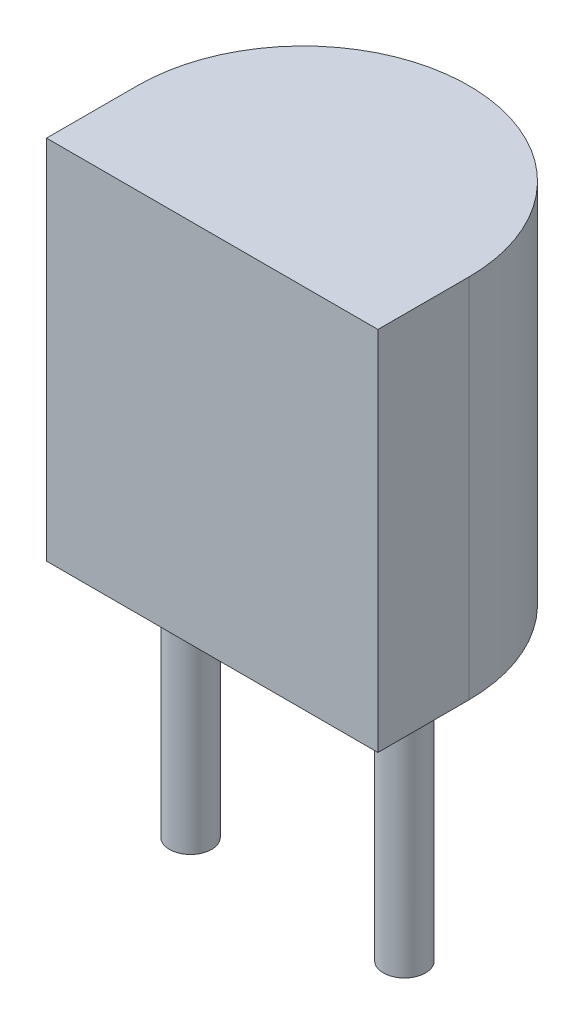
ISO-10303-21;
HEADER;
FILE_DESCRIPTION(('STEP AP214'),'2;1');
FILE_NAME('part.step','',(''),(''),'','','');
FILE_SCHEMA(('AUTOMOTIVE_DESIGN { 1 0 10303 214 1 1 1 1 }'));
ENDSEC;
DATA;
#1=APPLICATION_CONTEXT('core data for automotive mechanical design processes');
#2=APPLICATION_PROTOCOL_DEFINITION('international standard','automotive_design',2000,#1);
#3=PRODUCT_CONTEXT('',#1,'mechanical');
#4=PRODUCT('Part','Part','',(#3));
#5=PRODUCT_RELATED_PRODUCT_CATEGORY('part','',(#4));
#6=PRODUCT_DEFINITION_FORMATION('','',#4);
#7=PRODUCT_DEFINITION_CONTEXT('part definition',#1,'design');
#8=PRODUCT_DEFINITION('design','',#6,#7);
#9=PRODUCT_DEFINITION_SHAPE('','',#8);
#10=(LENGTH_UNIT() NAMED_UNIT(*) SI_UNIT(.MILLI.,.METRE.));
#11=(NAMED_UNIT(*) PLANE_ANGLE_UNIT() SI_UNIT($,.RADIAN.));
#12=(NAMED_UNIT(*) SI_UNIT($,.STERADIAN.) SOLID_ANGLE_UNIT());
#13=UNCERTAINTY_MEASURE_WITH_UNIT(LENGTH_MEASURE(1.E-05),#10,'distance_accuracy_value','');
#14=(GEOMETRIC_REPRESENTATION_CONTEXT(3) GLOBAL_UNCERTAINTY_ASSIGNED_CONTEXT((#13)) GLOBAL_UNIT_ASSIGNED_CONTEXT((#10,
#11,#12)) REPRESENTATION_CONTEXT('',''));
#15=CARTESIAN_POINT('',(0.,0.,0.));
#16=DIRECTION('',(0.,0.,1.));
#17=DIRECTION('',(1.,0.,0.));
#18=AXIS2_PLACEMENT_3D('',#15,#16,#17);
#19=CARTESIAN_POINT('',(-2.535,3.,-0.13));
#20=DIRECTION('',(0.,1.,0.));
#21=DIRECTION('',(0.,0.,1.));
#22=AXIS2_PLACEMENT_3D('',#19,#20,#21);
#23=PLANE('',#22);
#24=CARTESIAN_POINT('',(-2.54,3.,-2.54));
#25=DIRECTION('',(0.,1.,0.));
#26=DIRECTION('',(0.,0.,1.));
#27=AXIS2_PLACEMENT_3D('',#24,#25,#26);
#28=CIRCLE('',#27,0.500000000000001);
#29=CARTESIAN_POINT('',(-2.54,3.,-2.04));
#30=VERTEX_POINT('',#29);
#31=EDGE_CURVE('E42',#30,#30,#28,.F.);
#32=ORIENTED_EDGE('',*,*,#31,.F.);
#33=EDGE_LOOP('',(#32));
#34=FACE_BOUND('',#33,.T.);
#35=CARTESIAN_POINT('',(-2.535,3.,-0.13));
#36=DIRECTION('',(0.,1.,0.));
#37=DIRECTION('',(0.,0.,1.));
#38=AXIS2_PLACEMENT_3D('',#35,#36,#37);
#39=CIRCLE('',#38,3.935);
#40=CARTESIAN_POINT('',(1.4,3.,-0.13));
#41=VERTEX_POINT('',#40);
#42=CARTESIAN_POINT('',(-6.47,3.,-0.13));
#43=VERTEX_POINT('',#42);
#44=EDGE_CURVE('E101',#41,#43,#39,.T.);
#45=ORIENTED_EDGE('',*,*,#44,.F.);
#46=DIRECTION('',(0.,0.,-1.));
#47=VECTOR('',#46,1.);
#48=CARTESIAN_POINT('',(1.4,3.,-0.13));
#49=LINE('',#48,#47);
#50=CARTESIAN_POINT('',(1.4,3.,2.03));
#51=VERTEX_POINT('',#50);
#52=EDGE_CURVE('E73',#51,#41,#49,.T.);
#53=ORIENTED_EDGE('',*,*,#52,.F.);
#54=DIRECTION('',(1.,0.,0.));
#55=VECTOR('',#54,1.);
#56=CARTESIAN_POINT('',(1.4,3.,2.03));
#57=LINE('',#56,#55);
#58=CARTESIAN_POINT('',(-6.47,3.,2.03));
#59=VERTEX_POINT('',#58);
#60=EDGE_CURVE('E67',#59,#51,#57,.T.);
#61=ORIENTED_EDGE('',*,*,#60,.F.);
#62=DIRECTION('',(0.,0.,1.));
#63=VECTOR('',#62,1.);
#64=CARTESIAN_POINT('',(-6.47,3.,-0.13));
#65=LINE('',#64,#63);
#66=EDGE_CURVE('E91',#43,#59,#65,.T.);
#67=ORIENTED_EDGE('',*,*,#66,.F.);
#68=EDGE_LOOP('',(#45,#53,#61,#67));
#69=FACE_BOUND('',#68,.T.);
#70=CARTESIAN_POINT('',(0.,3.,0.));
#71=DIRECTION('',(0.,1.,0.));
#72=DIRECTION('',(0.,0.,1.));
#73=AXIS2_PLACEMENT_3D('',#70,#71,#72);
#74=CIRCLE('',#73,0.5);
#75=CARTESIAN_POINT('',(0.,3.,0.5));
#76=VERTEX_POINT('',#75);
#77=EDGE_CURVE('E111',#76,#76,#74,.F.);
#78=ORIENTED_EDGE('',*,*,#77,.F.);
#79=EDGE_LOOP('',(#78));
#80=FACE_BOUND('',#79,.T.);
#81=CARTESIAN_POINT('',(-5.08,3.,0.));
#82=DIRECTION('',(0.,1.,0.));
#83=DIRECTION('',(0.,0.,1.));
#84=AXIS2_PLACEMENT_3D('',#81,#82,#83);
#85=CIRCLE('',#84,0.5);
#86=CARTESIAN_POINT('',(-5.08,3.,0.5));
#87=VERTEX_POINT('',#86);
#88=EDGE_CURVE('E11',#87,#87,#85,.F.);
#89=ORIENTED_EDGE('',*,*,#88,.F.);
#90=EDGE_LOOP('',(#89));
#91=FACE_BOUND('',#90,.T.);
#92=ADVANCED_FACE('F33',(#34,#69,#80,#91),#23,.F.);
#93=CARTESIAN_POINT('',(-2.535,11.7,-0.13));
#94=DIRECTION('',(0.,-1.,0.));
#95=DIRECTION('',(0.,0.,-1.));
#96=AXIS2_PLACEMENT_3D('',#93,#94,#95);
#97=CYLINDRICAL_SURFACE('',#96,3.935);
#98=ORIENTED_EDGE('',*,*,#44,.T.);
#99=DIRECTION('',(0.,-1.,0.));
#100=VECTOR('',#99,1.);
#101=CARTESIAN_POINT('',(-6.47,11.7,-0.13));
#102=LINE('',#101,#100);
#103=CARTESIAN_POINT('',(-6.47,11.7,-0.13));
#104=VERTEX_POINT('',#103);
#105=EDGE_CURVE('E92',#104,#43,#102,.T.);
#106=ORIENTED_EDGE('',*,*,#105,.F.);
#107=CARTESIAN_POINT('',(-2.535,11.7,-0.13));
#108=DIRECTION('',(0.,1.,0.));
#109=DIRECTION('',(0.,0.,1.));
#110=AXIS2_PLACEMENT_3D('',#107,#108,#109);
#111=CIRCLE('',#110,3.935);
#112=CARTESIAN_POINT('',(1.4,11.7,-0.13));
#113=VERTEX_POINT('',#112);
#114=EDGE_CURVE('E86',#113,#104,#111,.T.);
#115=ORIENTED_EDGE('',*,*,#114,.F.);
#116=DIRECTION('',(0.,-1.,0.));
#117=VECTOR('',#116,1.);
#118=CARTESIAN_POINT('',(1.4,11.7,-0.13));
#119=LINE('',#118,#117);
#120=EDGE_CURVE('E97',#113,#41,#119,.T.);
#121=ORIENTED_EDGE('',*,*,#120,.T.);
#122=EDGE_LOOP('',(#98,#106,#115,#121));
#123=FACE_BOUND('',#122,.T.);
#124=ADVANCED_FACE('F35',(#123),#97,.T.);
#125=CARTESIAN_POINT('',(-6.47,11.7,-0.13));
#126=DIRECTION('',(1.,0.,0.));
#127=DIRECTION('',(0.,0.,-1.));
#128=AXIS2_PLACEMENT_3D('',#125,#126,#127);
#129=PLANE('',#128);
#130=ORIENTED_EDGE('',*,*,#66,.T.);
#131=DIRECTION('',(0.,-1.,0.));
#132=VECTOR('',#131,1.);
#133=CARTESIAN_POINT('',(-6.47,11.7,2.03));
#134=LINE('',#133,#132);
#135=CARTESIAN_POINT('',(-6.47,11.7,2.03));
#136=VERTEX_POINT('',#135);
#137=EDGE_CURVE('E89',#136,#59,#134,.T.);
#138=ORIENTED_EDGE('',*,*,#137,.F.);
#139=DIRECTION('',(0.,0.,1.));
#140=VECTOR('',#139,1.);
#141=CARTESIAN_POINT('',(-6.47,11.7,-0.13));
#142=LINE('',#141,#140);
#143=EDGE_CURVE('E81',#104,#136,#142,.T.);
#144=ORIENTED_EDGE('',*,*,#143,.F.);
#145=ORIENTED_EDGE('',*,*,#105,.T.);
#146=EDGE_LOOP('',(#130,#138,#144,#145));
#147=FACE_BOUND('',#146,.T.);
#148=ADVANCED_FACE('F90',(#147),#129,.F.);
#149=CARTESIAN_POINT('',(1.4,11.7,2.03));
#150=DIRECTION('',(0.,0.,-1.));
#151=DIRECTION('',(-1.,0.,0.));
#152=AXIS2_PLACEMENT_3D('',#149,#150,#151);
#153=PLANE('',#152);
#154=ORIENTED_EDGE('',*,*,#60,.T.);
#155=DIRECTION('',(0.,-1.,0.));
#156=VECTOR('',#155,1.);
#157=CARTESIAN_POINT('',(1.4,11.7,2.03));
#158=LINE('',#157,#156);
#159=CARTESIAN_POINT('',(1.4,11.7,2.03));
#160=VERTEX_POINT('',#159);
#161=EDGE_CURVE('E93',#160,#51,#158,.T.);
#162=ORIENTED_EDGE('',*,*,#161,.F.);
#163=DIRECTION('',(1.,0.,0.));
#164=VECTOR('',#163,1.);
#165=CARTESIAN_POINT('',(1.4,11.7,2.03));
#166=LINE('',#165,#164);
#167=EDGE_CURVE('E84',#136,#160,#166,.T.);
#168=ORIENTED_EDGE('',*,*,#167,.F.);
#169=ORIENTED_EDGE('',*,*,#137,.T.);
#170=EDGE_LOOP('',(#154,#162,#168,#169));
#171=FACE_BOUND('',#170,.T.);
#172=ADVANCED_FACE('F95',(#171),#153,.F.);
#173=CARTESIAN_POINT('',(1.4,11.7,-0.13));
#174=DIRECTION('',(-1.,0.,0.));
#175=DIRECTION('',(0.,0.,1.));
#176=AXIS2_PLACEMENT_3D('',#173,#174,#175);
#177=PLANE('',#176);
#178=ORIENTED_EDGE('',*,*,#52,.T.);
#179=ORIENTED_EDGE('',*,*,#120,.F.);
#180=DIRECTION('',(0.,0.,-1.));
#181=VECTOR('',#180,1.);
#182=CARTESIAN_POINT('',(1.4,11.7,-0.13));
#183=LINE('',#182,#181);
#184=EDGE_CURVE('E50',#160,#113,#183,.T.);
#185=ORIENTED_EDGE('',*,*,#184,.F.);
#186=ORIENTED_EDGE('',*,*,#161,.T.);
#187=EDGE_LOOP('',(#178,#179,#185,#186));
#188=FACE_BOUND('',#187,.T.);
#189=ADVANCED_FACE('F155',(#188),#177,.F.);
#190=CARTESIAN_POINT('',(-2.535,11.7,-0.13));
#191=DIRECTION('',(0.,1.,0.));
#192=DIRECTION('',(0.,0.,1.));
#193=AXIS2_PLACEMENT_3D('',#190,#191,#192);
#194=PLANE('',#193);
#195=ORIENTED_EDGE('',*,*,#114,.T.);
#196=ORIENTED_EDGE('',*,*,#143,.T.);
#197=ORIENTED_EDGE('',*,*,#167,.T.);
#198=ORIENTED_EDGE('',*,*,#184,.T.);
#199=EDGE_LOOP('',(#195,#196,#197,#198));
#200=FACE_BOUND('',#199,.T.);
#201=ADVANCED_FACE('F82',(#200),#194,.T.);
#202=CARTESIAN_POINT('',(0.,-3.,0.));
#203=DIRECTION('',(0.,1.,0.));
#204=DIRECTION('',(0.,0.,1.));
#205=AXIS2_PLACEMENT_3D('',#202,#203,#204);
#206=CYLINDRICAL_SURFACE('',#205,0.5);
#207=CARTESIAN_POINT('',(0.,-3.,0.));
#208=DIRECTION('',(0.,-1.,0.));
#209=DIRECTION('',(0.,0.,-1.));
#210=AXIS2_PLACEMENT_3D('',#207,#208,#209);
#211=CIRCLE('',#210,0.5);
#212=CARTESIAN_POINT('',(0.,-3.,-0.5));
#213=VERTEX_POINT('',#212);
#214=EDGE_CURVE('E104',#213,#213,#211,.T.);
#215=ORIENTED_EDGE('',*,*,#214,.F.);
#216=EDGE_LOOP('',(#215));
#217=FACE_BOUND('',#216,.T.);
#218=ORIENTED_EDGE('',*,*,#77,.T.);
#219=EDGE_LOOP('',(#218));
#220=FACE_BOUND('',#219,.T.);
#221=ADVANCED_FACE('F149',(#217,#220),#206,.T.);
#222=CARTESIAN_POINT('',(0.,-3.,0.));
#223=DIRECTION('',(0.,-1.,0.));
#224=DIRECTION('',(0.,0.,-1.));
#225=AXIS2_PLACEMENT_3D('',#222,#223,#224);
#226=PLANE('',#225);
#227=ORIENTED_EDGE('',*,*,#214,.T.);
#228=EDGE_LOOP('',(#227));
#229=FACE_BOUND('',#228,.T.);
#230=ADVANCED_FACE('F145',(#229),#226,.T.);
#231=CARTESIAN_POINT('',(-2.54,-3.,-2.54));
#232=DIRECTION('',(0.,1.,0.));
#233=DIRECTION('',(0.,0.,1.));
#234=AXIS2_PLACEMENT_3D('',#231,#232,#233);
#235=CYLINDRICAL_SURFACE('',#234,0.500000000000001);
#236=CARTESIAN_POINT('',(-2.54,-3.,-2.54));
#237=DIRECTION('',(0.,-1.,0.));
#238=DIRECTION('',(0.,0.,-1.));
#239=AXIS2_PLACEMENT_3D('',#236,#237,#238);
#240=CIRCLE('',#239,0.500000000000001);
#241=CARTESIAN_POINT('',(-2.54,-3.,-3.04));
#242=VERTEX_POINT('',#241);
#243=EDGE_CURVE('E170',#242,#242,#240,.T.);
#244=ORIENTED_EDGE('',*,*,#243,.F.);
#245=EDGE_LOOP('',(#244));
#246=FACE_BOUND('',#245,.T.);
#247=ORIENTED_EDGE('',*,*,#31,.T.);
#248=EDGE_LOOP('',(#247));
#249=FACE_BOUND('',#248,.T.);
#250=ADVANCED_FACE('F116',(#246,#249),#235,.T.);
#251=CARTESIAN_POINT('',(-2.54,-3.,-2.54));
#252=DIRECTION('',(0.,-1.,0.));
#253=DIRECTION('',(0.,0.,-1.));
#254=AXIS2_PLACEMENT_3D('',#251,#252,#253);
#255=PLANE('',#254);
#256=ORIENTED_EDGE('',*,*,#243,.T.);
#257=EDGE_LOOP('',(#256));
#258=FACE_BOUND('',#257,.T.);
#259=ADVANCED_FACE('F130',(#258),#255,.T.);
#260=CARTESIAN_POINT('',(-5.08,-3.,0.));
#261=DIRECTION('',(0.,1.,0.));
#262=DIRECTION('',(0.,0.,1.));
#263=AXIS2_PLACEMENT_3D('',#260,#261,#262);
#264=CYLINDRICAL_SURFACE('',#263,0.5);
#265=CARTESIAN_POINT('',(-5.08,-3.,0.));
#266=DIRECTION('',(0.,-1.,0.));
#267=DIRECTION('',(0.,0.,1.));
#268=AXIS2_PLACEMENT_3D('',#265,#266,#267);
#269=CIRCLE('',#268,0.5);
#270=CARTESIAN_POINT('',(-5.08,-3.,0.5));
#271=VERTEX_POINT('',#270);
#272=EDGE_CURVE('E173',#271,#271,#269,.T.);
#273=ORIENTED_EDGE('',*,*,#272,.F.);
#274=EDGE_LOOP('',(#273));
#275=FACE_BOUND('',#274,.T.);
#276=ORIENTED_EDGE('',*,*,#88,.T.);
#277=EDGE_LOOP('',(#276));
#278=FACE_BOUND('',#277,.T.);
#279=ADVANCED_FACE('F127',(#275,#278),#264,.T.);
#280=CARTESIAN_POINT('',(-5.08,-3.,0.));
#281=DIRECTION('',(0.,1.,0.));
#282=DIRECTION('',(0.,0.,1.));
#283=AXIS2_PLACEMENT_3D('',#280,#281,#282);
#284=PLANE('',#283);
#285=ORIENTED_EDGE('',*,*,#272,.T.);
#286=EDGE_LOOP('',(#285));
#287=FACE_BOUND('',#286,.T.);
#288=ADVANCED_FACE('F129',(#287),#284,.F.);
#289=CLOSED_SHELL('',(#92,#124,#148,#172,#189,#201,#221,#230,#250,#259,#279,#288));
#290=MANIFOLD_SOLID_BREP('B2',#289);
#291=ADVANCED_BREP_SHAPE_REPRESENTATION('',(#18,#290),#14);
#292=SHAPE_DEFINITION_REPRESENTATION(#9,#291);
ENDSEC;
END-ISO-10303-21;
